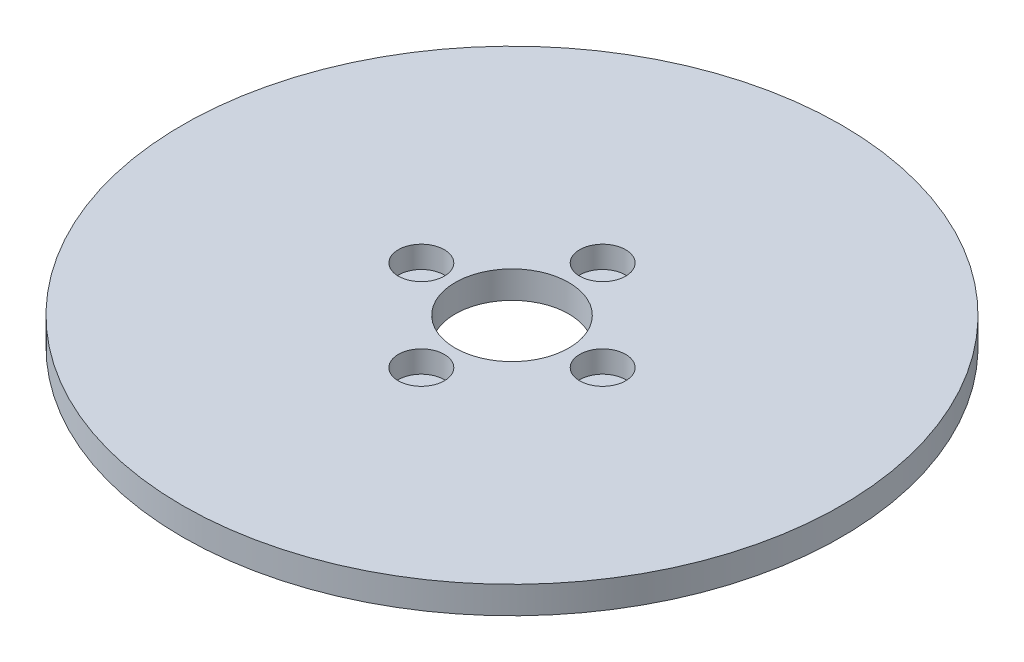
ISO-10303-21;
HEADER;
FILE_DESCRIPTION(('STEP AP214'),'2;1');
FILE_NAME('part.step','',(''),(''),'','','');
FILE_SCHEMA(('AUTOMOTIVE_DESIGN { 1 0 10303 214 1 1 1 1 }'));
ENDSEC;
DATA;
#1=APPLICATION_CONTEXT('core data for automotive mechanical design processes');
#2=APPLICATION_PROTOCOL_DEFINITION('international standard','automotive_design',2000,#1);
#3=PRODUCT_CONTEXT('',#1,'mechanical');
#4=PRODUCT('Part','Part','',(#3));
#5=PRODUCT_RELATED_PRODUCT_CATEGORY('part','',(#4));
#6=PRODUCT_DEFINITION_FORMATION('','',#4);
#7=PRODUCT_DEFINITION_CONTEXT('part definition',#1,'design');
#8=PRODUCT_DEFINITION('design','',#6,#7);
#9=PRODUCT_DEFINITION_SHAPE('','',#8);
#10=(LENGTH_UNIT() NAMED_UNIT(*) SI_UNIT(.MILLI.,.METRE.));
#11=(NAMED_UNIT(*) PLANE_ANGLE_UNIT() SI_UNIT($,.RADIAN.));
#12=(NAMED_UNIT(*) SI_UNIT($,.STERADIAN.) SOLID_ANGLE_UNIT());
#13=UNCERTAINTY_MEASURE_WITH_UNIT(LENGTH_MEASURE(1.E-05),#10,'distance_accuracy_value','');
#14=(GEOMETRIC_REPRESENTATION_CONTEXT(3) GLOBAL_UNCERTAINTY_ASSIGNED_CONTEXT((#13)) GLOBAL_UNIT_ASSIGNED_CONTEXT((#10,
#11,#12)) REPRESENTATION_CONTEXT('',''));
#15=CARTESIAN_POINT('',(0.,0.,0.));
#16=DIRECTION('',(0.,0.,1.));
#17=DIRECTION('',(1.,0.,0.));
#18=AXIS2_PLACEMENT_3D('',#15,#16,#17);
#19=CARTESIAN_POINT('',(0.,6.,0.));
#20=DIRECTION('',(0.,-1.,0.));
#21=DIRECTION('',(0.,0.,-1.));
#22=AXIS2_PLACEMENT_3D('',#19,#20,#21);
#23=CYLINDRICAL_SURFACE('',#22,72.5);
#24=CARTESIAN_POINT('',(0.,6.,0.));
#25=DIRECTION('',(0.,1.,0.));
#26=DIRECTION('',(0.,0.,1.));
#27=AXIS2_PLACEMENT_3D('',#24,#25,#26);
#28=CIRCLE('',#27,72.5);
#29=CARTESIAN_POINT('',(0.,6.,72.5));
#30=VERTEX_POINT('',#29);
#31=EDGE_CURVE('E10',#30,#30,#28,.T.);
#32=ORIENTED_EDGE('',*,*,#31,.F.);
#33=EDGE_LOOP('',(#32));
#34=FACE_BOUND('',#33,.T.);
#35=CARTESIAN_POINT('',(0.,0.,0.));
#36=DIRECTION('',(0.,1.,0.));
#37=DIRECTION('',(0.,0.,1.));
#38=AXIS2_PLACEMENT_3D('',#35,#36,#37);
#39=CIRCLE('',#38,72.5);
#40=CARTESIAN_POINT('',(0.,0.,72.5));
#41=VERTEX_POINT('',#40);
#42=EDGE_CURVE('E37',#41,#41,#39,.T.);
#43=ORIENTED_EDGE('',*,*,#42,.T.);
#44=EDGE_LOOP('',(#43));
#45=FACE_BOUND('',#44,.T.);
#46=ADVANCED_FACE('F40',(#34,#45),#23,.T.);
#47=CARTESIAN_POINT('',(0.,6.,0.));
#48=DIRECTION('',(0.,1.,0.));
#49=DIRECTION('',(0.,0.,1.));
#50=AXIS2_PLACEMENT_3D('',#47,#48,#49);
#51=PLANE('',#50);
#52=CARTESIAN_POINT('',(0.,6.,19.9435984685109));
#53=DIRECTION('',(0.,1.,0.));
#54=DIRECTION('',(1.,0.,0.));
#55=AXIS2_PLACEMENT_3D('',#52,#53,#54);
#56=CIRCLE('',#55,5.05303270644476);
#57=CARTESIAN_POINT('',(5.05303270644483,6.,19.9435984685109));
#58=VERTEX_POINT('',#57);
#59=EDGE_CURVE('E71',#58,#58,#56,.T.);
#60=ORIENTED_EDGE('',*,*,#59,.F.);
#61=EDGE_LOOP('',(#60));
#62=FACE_BOUND('',#61,.T.);
#63=CARTESIAN_POINT('',(19.9435984685109,6.,0.));
#64=DIRECTION('',(0.,1.,0.));
#65=DIRECTION('',(0.,0.,-1.));
#66=AXIS2_PLACEMENT_3D('',#63,#64,#65);
#67=CIRCLE('',#66,5.05303270644476);
#68=CARTESIAN_POINT('',(19.9435984685109,6.,-5.05303270644476));
#69=VERTEX_POINT('',#68);
#70=EDGE_CURVE('E70',#69,#69,#67,.T.);
#71=ORIENTED_EDGE('',*,*,#70,.F.);
#72=EDGE_LOOP('',(#71));
#73=FACE_BOUND('',#72,.T.);
#74=CARTESIAN_POINT('',(-2.08898105646559E-13,6.,-19.9435984685109));
#75=DIRECTION('',(0.,1.,0.));
#76=DIRECTION('',(-1.,0.,0.));
#77=AXIS2_PLACEMENT_3D('',#74,#75,#76);
#78=CIRCLE('',#77,5.05303270644476);
#79=CARTESIAN_POINT('',(-5.05303270644497,6.,-19.9435984685108));
#80=VERTEX_POINT('',#79);
#81=EDGE_CURVE('E61',#80,#80,#78,.T.);
#82=ORIENTED_EDGE('',*,*,#81,.F.);
#83=EDGE_LOOP('',(#82));
#84=FACE_BOUND('',#83,.T.);
#85=CARTESIAN_POINT('',(-19.9435984685109,6.,0.));
#86=DIRECTION('',(0.,1.,0.));
#87=DIRECTION('',(0.,0.,1.));
#88=AXIS2_PLACEMENT_3D('',#85,#86,#87);
#89=CIRCLE('',#88,5.05303270644476);
#90=CARTESIAN_POINT('',(-19.9435984685109,6.,5.05303270644476));
#91=VERTEX_POINT('',#90);
#92=EDGE_CURVE('E54',#91,#91,#89,.T.);
#93=ORIENTED_EDGE('',*,*,#92,.F.);
#94=EDGE_LOOP('',(#93));
#95=FACE_BOUND('',#94,.T.);
#96=CARTESIAN_POINT('',(0.,6.,0.));
#97=DIRECTION('',(0.,1.,0.));
#98=DIRECTION('',(0.,0.,1.));
#99=AXIS2_PLACEMENT_3D('',#96,#97,#98);
#100=CIRCLE('',#99,12.5);
#101=CARTESIAN_POINT('',(0.,6.,12.5));
#102=VERTEX_POINT('',#101);
#103=EDGE_CURVE('E50',#102,#102,#100,.T.);
#104=ORIENTED_EDGE('',*,*,#103,.F.);
#105=EDGE_LOOP('',(#104));
#106=FACE_BOUND('',#105,.T.);
#107=ORIENTED_EDGE('',*,*,#31,.T.);
#108=EDGE_LOOP('',(#107));
#109=FACE_BOUND('',#108,.T.);
#110=ADVANCED_FACE('F86',(#62,#73,#84,#95,#106,#109),#51,.T.);
#111=CARTESIAN_POINT('',(0.,0.,0.));
#112=DIRECTION('',(0.,1.,0.));
#113=DIRECTION('',(0.,0.,1.));
#114=AXIS2_PLACEMENT_3D('',#111,#112,#113);
#115=PLANE('',#114);
#116=CARTESIAN_POINT('',(0.,0.,0.));
#117=DIRECTION('',(0.,1.,0.));
#118=DIRECTION('',(0.,0.,1.));
#119=AXIS2_PLACEMENT_3D('',#116,#117,#118);
#120=CIRCLE('',#119,12.5);
#121=CARTESIAN_POINT('',(0.,0.,12.5));
#122=VERTEX_POINT('',#121);
#123=EDGE_CURVE('E47',#122,#122,#120,.T.);
#124=ORIENTED_EDGE('',*,*,#123,.T.);
#125=EDGE_LOOP('',(#124));
#126=FACE_BOUND('',#125,.T.);
#127=ORIENTED_EDGE('',*,*,#42,.F.);
#128=EDGE_LOOP('',(#127));
#129=FACE_BOUND('',#128,.T.);
#130=ADVANCED_FACE('F93',(#126,#129),#115,.F.);
#131=CARTESIAN_POINT('',(0.,6.,0.));
#132=DIRECTION('',(0.,-1.,0.));
#133=DIRECTION('',(0.,0.,-1.));
#134=AXIS2_PLACEMENT_3D('',#131,#132,#133);
#135=CYLINDRICAL_SURFACE('',#134,12.5);
#136=ORIENTED_EDGE('',*,*,#103,.T.);
#137=EDGE_LOOP('',(#136));
#138=FACE_BOUND('',#137,.T.);
#139=ORIENTED_EDGE('',*,*,#123,.F.);
#140=EDGE_LOOP('',(#139));
#141=FACE_BOUND('',#140,.T.);
#142=ADVANCED_FACE('F101',(#138,#141),#135,.F.);
#143=CARTESIAN_POINT('',(-19.9435984685109,1.17309744418196,0.));
#144=DIRECTION('',(0.,1.,0.));
#145=DIRECTION('',(0.,0.,1.));
#146=AXIS2_PLACEMENT_3D('',#143,#144,#145);
#147=CYLINDRICAL_SURFACE('',#146,5.05303270644476);
#148=CARTESIAN_POINT('',(-19.9435984685109,1.17309744418196,0.));
#149=DIRECTION('',(0.,1.,0.));
#150=DIRECTION('',(0.,0.,1.));
#151=AXIS2_PLACEMENT_3D('',#148,#149,#150);
#152=CIRCLE('',#151,5.05303270644476);
#153=CARTESIAN_POINT('',(-19.9435984685109,1.17309744418196,5.05303270644476));
#154=VERTEX_POINT('',#153);
#155=EDGE_CURVE('E55',#154,#154,#152,.T.);
#156=ORIENTED_EDGE('',*,*,#155,.F.);
#157=EDGE_LOOP('',(#156));
#158=FACE_BOUND('',#157,.T.);
#159=ORIENTED_EDGE('',*,*,#92,.T.);
#160=EDGE_LOOP('',(#159));
#161=FACE_BOUND('',#160,.T.);
#162=ADVANCED_FACE('F102',(#158,#161),#147,.F.);
#163=CARTESIAN_POINT('',(-19.9435984685109,1.17309744418196,0.));
#164=DIRECTION('',(0.,1.,0.));
#165=DIRECTION('',(0.,0.,1.));
#166=AXIS2_PLACEMENT_3D('',#163,#164,#165);
#167=PLANE('',#166);
#168=ORIENTED_EDGE('',*,*,#155,.T.);
#169=EDGE_LOOP('',(#168));
#170=FACE_BOUND('',#169,.T.);
#171=ADVANCED_FACE('F133',(#170),#167,.T.);
#172=CARTESIAN_POINT('',(-2.08898105646559E-13,1.17309744418196,-19.9435984685109));
#173=DIRECTION('',(0.,1.,0.));
#174=DIRECTION('',(0.,0.,1.));
#175=AXIS2_PLACEMENT_3D('',#172,#173,#174);
#176=CYLINDRICAL_SURFACE('',#175,5.05303270644476);
#177=CARTESIAN_POINT('',(-2.08898105646559E-13,1.17309744418196,-19.9435984685109));
#178=DIRECTION('',(0.,1.,0.));
#179=DIRECTION('',(-1.,0.,0.));
#180=AXIS2_PLACEMENT_3D('',#177,#178,#179);
#181=CIRCLE('',#180,5.05303270644476);
#182=CARTESIAN_POINT('',(-5.05303270644497,1.17309744418196,-19.9435984685108));
#183=VERTEX_POINT('',#182);
#184=EDGE_CURVE('E63',#183,#183,#181,.T.);
#185=ORIENTED_EDGE('',*,*,#184,.F.);
#186=EDGE_LOOP('',(#185));
#187=FACE_BOUND('',#186,.T.);
#188=ORIENTED_EDGE('',*,*,#81,.T.);
#189=EDGE_LOOP('',(#188));
#190=FACE_BOUND('',#189,.T.);
#191=ADVANCED_FACE('F142',(#187,#190),#176,.F.);
#192=CARTESIAN_POINT('',(-2.08898105646559E-13,1.17309744418196,-19.9435984685109));
#193=DIRECTION('',(0.,1.,0.));
#194=DIRECTION('',(-1.,0.,0.));
#195=AXIS2_PLACEMENT_3D('',#192,#193,#194);
#196=PLANE('',#195);
#197=ORIENTED_EDGE('',*,*,#184,.T.);
#198=EDGE_LOOP('',(#197));
#199=FACE_BOUND('',#198,.T.);
#200=ADVANCED_FACE('F156',(#199),#196,.T.);
#201=CARTESIAN_POINT('',(19.9435984685109,1.17309744418196,0.));
#202=DIRECTION('',(0.,1.,0.));
#203=DIRECTION('',(0.,0.,1.));
#204=AXIS2_PLACEMENT_3D('',#201,#202,#203);
#205=CYLINDRICAL_SURFACE('',#204,5.05303270644476);
#206=CARTESIAN_POINT('',(19.9435984685109,1.17309744418196,0.));
#207=DIRECTION('',(0.,1.,0.));
#208=DIRECTION('',(0.,0.,-1.));
#209=AXIS2_PLACEMENT_3D('',#206,#207,#208);
#210=CIRCLE('',#209,5.05303270644476);
#211=CARTESIAN_POINT('',(19.9435984685109,1.17309744418196,-5.05303270644476));
#212=VERTEX_POINT('',#211);
#213=EDGE_CURVE('E69',#212,#212,#210,.T.);
#214=ORIENTED_EDGE('',*,*,#213,.F.);
#215=EDGE_LOOP('',(#214));
#216=FACE_BOUND('',#215,.T.);
#217=ORIENTED_EDGE('',*,*,#70,.T.);
#218=EDGE_LOOP('',(#217));
#219=FACE_BOUND('',#218,.T.);
#220=ADVANCED_FACE('F164',(#216,#219),#205,.F.);
#221=CARTESIAN_POINT('',(19.9435984685109,1.17309744418196,0.));
#222=DIRECTION('',(0.,1.,0.));
#223=DIRECTION('',(0.,0.,-1.));
#224=AXIS2_PLACEMENT_3D('',#221,#222,#223);
#225=PLANE('',#224);
#226=ORIENTED_EDGE('',*,*,#213,.T.);
#227=EDGE_LOOP('',(#226));
#228=FACE_BOUND('',#227,.T.);
#229=ADVANCED_FACE('F83',(#228),#225,.T.);
#230=CARTESIAN_POINT('',(0.,1.17309744418196,19.9435984685109));
#231=DIRECTION('',(0.,1.,0.));
#232=DIRECTION('',(0.,0.,1.));
#233=AXIS2_PLACEMENT_3D('',#230,#231,#232);
#234=CYLINDRICAL_SURFACE('',#233,5.05303270644476);
#235=CARTESIAN_POINT('',(0.,1.17309744418196,19.9435984685109));
#236=DIRECTION('',(0.,1.,0.));
#237=DIRECTION('',(1.,0.,0.));
#238=AXIS2_PLACEMENT_3D('',#235,#236,#237);
#239=CIRCLE('',#238,5.05303270644476);
#240=CARTESIAN_POINT('',(5.05303270644483,1.17309744418196,19.9435984685109));
#241=VERTEX_POINT('',#240);
#242=EDGE_CURVE('E59',#241,#241,#239,.T.);
#243=ORIENTED_EDGE('',*,*,#242,.F.);
#244=EDGE_LOOP('',(#243));
#245=FACE_BOUND('',#244,.T.);
#246=ORIENTED_EDGE('',*,*,#59,.T.);
#247=EDGE_LOOP('',(#246));
#248=FACE_BOUND('',#247,.T.);
#249=ADVANCED_FACE('F81',(#245,#248),#234,.F.);
#250=CARTESIAN_POINT('',(0.,1.17309744418196,19.9435984685109));
#251=DIRECTION('',(0.,1.,0.));
#252=DIRECTION('',(1.,0.,0.));
#253=AXIS2_PLACEMENT_3D('',#250,#251,#252);
#254=PLANE('',#253);
#255=ORIENTED_EDGE('',*,*,#242,.T.);
#256=EDGE_LOOP('',(#255));
#257=FACE_BOUND('',#256,.T.);
#258=ADVANCED_FACE('F78',(#257),#254,.T.);
#259=CLOSED_SHELL('',(#46,#110,#130,#142,#162,#171,#191,#200,#220,#229,#249,#258));
#260=MANIFOLD_SOLID_BREP('B2',#259);
#261=ADVANCED_BREP_SHAPE_REPRESENTATION('',(#18,#260),#14);
#262=SHAPE_DEFINITION_REPRESENTATION(#9,#261);
ENDSEC;
END-ISO-10303-21;
